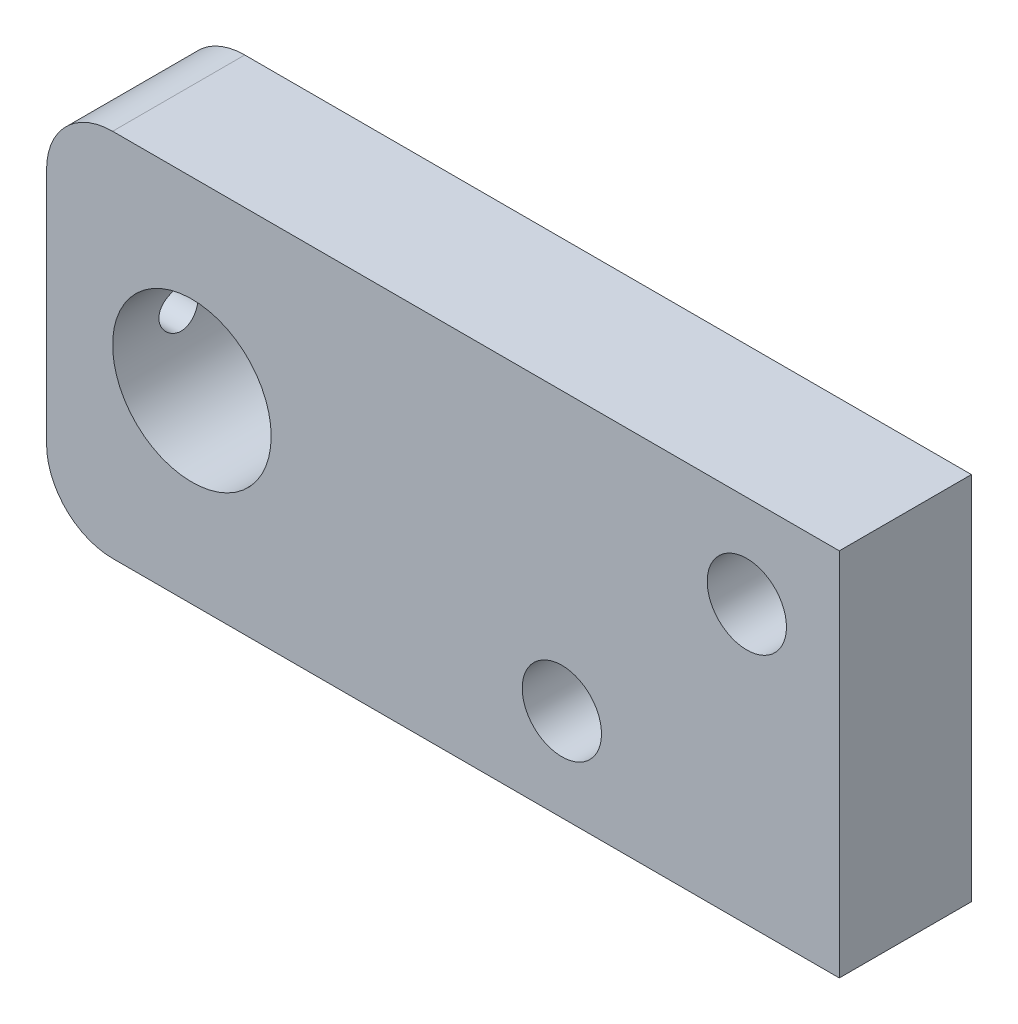
ISO-10303-21;
HEADER;
FILE_DESCRIPTION(('STEP AP214'),'2;1');
FILE_NAME('part.step','',(''),(''),'','','');
FILE_SCHEMA(('AUTOMOTIVE_DESIGN { 1 0 10303 214 1 1 1 1 }'));
ENDSEC;
DATA;
#1=APPLICATION_CONTEXT('core data for automotive mechanical design processes');
#2=APPLICATION_PROTOCOL_DEFINITION('international standard','automotive_design',2000,#1);
#3=PRODUCT_CONTEXT('',#1,'mechanical');
#4=PRODUCT('Part','Part','',(#3));
#5=PRODUCT_RELATED_PRODUCT_CATEGORY('part','',(#4));
#6=PRODUCT_DEFINITION_FORMATION('','',#4);
#7=PRODUCT_DEFINITION_CONTEXT('part definition',#1,'design');
#8=PRODUCT_DEFINITION('design','',#6,#7);
#9=PRODUCT_DEFINITION_SHAPE('','',#8);
#10=(LENGTH_UNIT() NAMED_UNIT(*) SI_UNIT(.MILLI.,.METRE.));
#11=(NAMED_UNIT(*) PLANE_ANGLE_UNIT() SI_UNIT($,.RADIAN.));
#12=(NAMED_UNIT(*) SI_UNIT($,.STERADIAN.) SOLID_ANGLE_UNIT());
#13=UNCERTAINTY_MEASURE_WITH_UNIT(LENGTH_MEASURE(1.E-05),#10,'distance_accuracy_value','');
#14=(GEOMETRIC_REPRESENTATION_CONTEXT(3) GLOBAL_UNCERTAINTY_ASSIGNED_CONTEXT((#13)) GLOBAL_UNIT_ASSIGNED_CONTEXT((#10,
#11,#12)) REPRESENTATION_CONTEXT('',''));
#15=CARTESIAN_POINT('',(0.,0.,0.));
#16=DIRECTION('',(0.,0.,1.));
#17=DIRECTION('',(1.,0.,0.));
#18=AXIS2_PLACEMENT_3D('',#15,#16,#17);
#19=CARTESIAN_POINT('',(-25.,9.,10.));
#20=DIRECTION('',(0.,0.,1.));
#21=DIRECTION('',(1.,0.,0.));
#22=AXIS2_PLACEMENT_3D('',#19,#20,#21);
#23=PLANE('',#22);
#24=CARTESIAN_POINT('',(-19.,0.,10.));
#25=DIRECTION('',(0.,0.,1.));
#26=DIRECTION('',(1.,0.,0.));
#27=AXIS2_PLACEMENT_3D('',#24,#25,#26);
#28=CIRCLE('',#27,6.);
#29=CARTESIAN_POINT('',(-13.,0.,10.));
#30=VERTEX_POINT('',#29);
#31=EDGE_CURVE('E192',#30,#30,#28,.T.);
#32=ORIENTED_EDGE('',*,*,#31,.F.);
#33=EDGE_LOOP('',(#32));
#34=FACE_BOUND('',#33,.T.);
#35=DIRECTION('',(0.,1.,0.));
#36=VECTOR('',#35,1.);
#37=CARTESIAN_POINT('',(30.,-14.,10.));
#38=LINE('',#37,#36);
#39=CARTESIAN_POINT('',(30.,-14.,10.));
#40=VERTEX_POINT('',#39);
#41=CARTESIAN_POINT('',(30.,14.,10.));
#42=VERTEX_POINT('',#41);
#43=EDGE_CURVE('E129',#40,#42,#38,.T.);
#44=ORIENTED_EDGE('',*,*,#43,.T.);
#45=DIRECTION('',(-1.,0.,0.));
#46=VECTOR('',#45,1.);
#47=CARTESIAN_POINT('',(30.,14.,10.));
#48=LINE('',#47,#46);
#49=CARTESIAN_POINT('',(-25.,14.,10.));
#50=VERTEX_POINT('',#49);
#51=EDGE_CURVE('E87',#42,#50,#48,.T.);
#52=ORIENTED_EDGE('',*,*,#51,.T.);
#53=CARTESIAN_POINT('',(-25.,9.,10.));
#54=DIRECTION('',(0.,0.,1.));
#55=DIRECTION('',(1.,0.,0.));
#56=AXIS2_PLACEMENT_3D('',#53,#54,#55);
#57=CIRCLE('',#56,5.);
#58=CARTESIAN_POINT('',(-30.,9.,10.));
#59=VERTEX_POINT('',#58);
#60=EDGE_CURVE('E100',#50,#59,#57,.T.);
#61=ORIENTED_EDGE('',*,*,#60,.T.);
#62=DIRECTION('',(0.,-1.,0.));
#63=VECTOR('',#62,1.);
#64=CARTESIAN_POINT('',(-30.,-9.00000000000001,10.));
#65=LINE('',#64,#63);
#66=CARTESIAN_POINT('',(-30.,-9.00000000000001,10.));
#67=VERTEX_POINT('',#66);
#68=EDGE_CURVE('E94',#59,#67,#65,.T.);
#69=ORIENTED_EDGE('',*,*,#68,.T.);
#70=CARTESIAN_POINT('',(-25.,-9.00000000000001,10.));
#71=DIRECTION('',(0.,0.,1.));
#72=DIRECTION('',(-1.,0.,0.));
#73=AXIS2_PLACEMENT_3D('',#70,#71,#72);
#74=CIRCLE('',#73,5.);
#75=CARTESIAN_POINT('',(-25.,-14.,10.));
#76=VERTEX_POINT('',#75);
#77=EDGE_CURVE('E98',#67,#76,#74,.T.);
#78=ORIENTED_EDGE('',*,*,#77,.T.);
#79=DIRECTION('',(1.,0.,0.));
#80=VECTOR('',#79,1.);
#81=CARTESIAN_POINT('',(30.,-14.,10.));
#82=LINE('',#81,#80);
#83=EDGE_CURVE('E50',#76,#40,#82,.T.);
#84=ORIENTED_EDGE('',*,*,#83,.T.);
#85=EDGE_LOOP('',(#44,#52,#61,#69,#78,#84));
#86=FACE_BOUND('',#85,.T.);
#87=CARTESIAN_POINT('',(23.,7.,10.));
#88=DIRECTION('',(0.,0.,1.));
#89=DIRECTION('',(1.,0.,0.));
#90=AXIS2_PLACEMENT_3D('',#87,#88,#89);
#91=CIRCLE('',#90,3.);
#92=CARTESIAN_POINT('',(26.,7.,10.));
#93=VERTEX_POINT('',#92);
#94=EDGE_CURVE('E122',#93,#93,#91,.T.);
#95=ORIENTED_EDGE('',*,*,#94,.F.);
#96=EDGE_LOOP('',(#95));
#97=FACE_BOUND('',#96,.T.);
#98=CARTESIAN_POINT('',(9.00000000000001,-7.,10.));
#99=DIRECTION('',(0.,0.,1.));
#100=DIRECTION('',(1.,0.,0.));
#101=AXIS2_PLACEMENT_3D('',#98,#99,#100);
#102=CIRCLE('',#101,3.);
#103=CARTESIAN_POINT('',(12.,-7.,10.));
#104=VERTEX_POINT('',#103);
#105=EDGE_CURVE('E185',#104,#104,#102,.T.);
#106=ORIENTED_EDGE('',*,*,#105,.F.);
#107=EDGE_LOOP('',(#106));
#108=FACE_BOUND('',#107,.T.);
#109=ADVANCED_FACE('F33',(#34,#86,#97,#108),#23,.T.);
#110=CARTESIAN_POINT('',(-25.,9.,0.));
#111=DIRECTION('',(0.,0.,1.));
#112=DIRECTION('',(1.,0.,0.));
#113=AXIS2_PLACEMENT_3D('',#110,#111,#112);
#114=PLANE('',#113);
#115=DIRECTION('',(0.,1.,0.));
#116=VECTOR('',#115,1.);
#117=CARTESIAN_POINT('',(30.,-14.,0.));
#118=LINE('',#117,#116);
#119=CARTESIAN_POINT('',(30.,-14.,0.));
#120=VERTEX_POINT('',#119);
#121=CARTESIAN_POINT('',(30.,14.,0.));
#122=VERTEX_POINT('',#121);
#123=EDGE_CURVE('E118',#120,#122,#118,.T.);
#124=ORIENTED_EDGE('',*,*,#123,.F.);
#125=DIRECTION('',(1.,0.,0.));
#126=VECTOR('',#125,1.);
#127=CARTESIAN_POINT('',(30.,-14.,0.));
#128=LINE('',#127,#126);
#129=CARTESIAN_POINT('',(-25.,-14.,0.));
#130=VERTEX_POINT('',#129);
#131=EDGE_CURVE('E79',#130,#120,#128,.T.);
#132=ORIENTED_EDGE('',*,*,#131,.F.);
#133=CARTESIAN_POINT('',(-25.,-9.00000000000001,0.));
#134=DIRECTION('',(0.,0.,1.));
#135=DIRECTION('',(-1.,0.,0.));
#136=AXIS2_PLACEMENT_3D('',#133,#134,#135);
#137=CIRCLE('',#136,5.);
#138=CARTESIAN_POINT('',(-30.,-9.00000000000001,0.));
#139=VERTEX_POINT('',#138);
#140=EDGE_CURVE('E73',#139,#130,#137,.T.);
#141=ORIENTED_EDGE('',*,*,#140,.F.);
#142=DIRECTION('',(0.,-1.,0.));
#143=VECTOR('',#142,1.);
#144=CARTESIAN_POINT('',(-30.,-9.00000000000001,0.));
#145=LINE('',#144,#143);
#146=CARTESIAN_POINT('',(-30.,9.,0.));
#147=VERTEX_POINT('',#146);
#148=EDGE_CURVE('E108',#147,#139,#145,.T.);
#149=ORIENTED_EDGE('',*,*,#148,.F.);
#150=CARTESIAN_POINT('',(-25.,9.,0.));
#151=DIRECTION('',(0.,0.,1.));
#152=DIRECTION('',(1.,0.,0.));
#153=AXIS2_PLACEMENT_3D('',#150,#151,#152);
#154=CIRCLE('',#153,5.);
#155=CARTESIAN_POINT('',(-25.,14.,0.));
#156=VERTEX_POINT('',#155);
#157=EDGE_CURVE('E124',#156,#147,#154,.T.);
#158=ORIENTED_EDGE('',*,*,#157,.F.);
#159=DIRECTION('',(-1.,0.,0.));
#160=VECTOR('',#159,1.);
#161=CARTESIAN_POINT('',(30.,14.,0.));
#162=LINE('',#161,#160);
#163=EDGE_CURVE('E121',#122,#156,#162,.T.);
#164=ORIENTED_EDGE('',*,*,#163,.F.);
#165=EDGE_LOOP('',(#124,#132,#141,#149,#158,#164));
#166=FACE_BOUND('',#165,.T.);
#167=CARTESIAN_POINT('',(23.,7.,0.));
#168=DIRECTION('',(0.,0.,1.));
#169=DIRECTION('',(1.,0.,0.));
#170=AXIS2_PLACEMENT_3D('',#167,#168,#169);
#171=CIRCLE('',#170,3.);
#172=CARTESIAN_POINT('',(26.,7.,0.));
#173=VERTEX_POINT('',#172);
#174=EDGE_CURVE('E195',#173,#173,#171,.T.);
#175=ORIENTED_EDGE('',*,*,#174,.T.);
#176=EDGE_LOOP('',(#175));
#177=FACE_BOUND('',#176,.T.);
#178=CARTESIAN_POINT('',(-19.,0.,0.));
#179=DIRECTION('',(0.,0.,1.));
#180=DIRECTION('',(1.,0.,0.));
#181=AXIS2_PLACEMENT_3D('',#178,#179,#180);
#182=CIRCLE('',#181,6.);
#183=CARTESIAN_POINT('',(-13.,0.,0.));
#184=VERTEX_POINT('',#183);
#185=EDGE_CURVE('E188',#184,#184,#182,.T.);
#186=ORIENTED_EDGE('',*,*,#185,.T.);
#187=EDGE_LOOP('',(#186));
#188=FACE_BOUND('',#187,.T.);
#189=CARTESIAN_POINT('',(9.00000000000001,-7.,0.));
#190=DIRECTION('',(0.,0.,1.));
#191=DIRECTION('',(1.,0.,0.));
#192=AXIS2_PLACEMENT_3D('',#189,#190,#191);
#193=CIRCLE('',#192,3.);
#194=CARTESIAN_POINT('',(12.,-7.,0.));
#195=VERTEX_POINT('',#194);
#196=EDGE_CURVE('E189',#195,#195,#193,.T.);
#197=ORIENTED_EDGE('',*,*,#196,.T.);
#198=EDGE_LOOP('',(#197));
#199=FACE_BOUND('',#198,.T.);
#200=ADVANCED_FACE('F138',(#166,#177,#188,#199),#114,.F.);
#201=CARTESIAN_POINT('',(30.,-14.,10.));
#202=DIRECTION('',(-1.,0.,0.));
#203=DIRECTION('',(0.,0.,1.));
#204=AXIS2_PLACEMENT_3D('',#201,#202,#203);
#205=PLANE('',#204);
#206=ORIENTED_EDGE('',*,*,#123,.T.);
#207=DIRECTION('',(0.,0.,-1.));
#208=VECTOR('',#207,1.);
#209=CARTESIAN_POINT('',(30.,14.,10.));
#210=LINE('',#209,#208);
#211=EDGE_CURVE('E11',#42,#122,#210,.T.);
#212=ORIENTED_EDGE('',*,*,#211,.F.);
#213=ORIENTED_EDGE('',*,*,#43,.F.);
#214=DIRECTION('',(0.,0.,-1.));
#215=VECTOR('',#214,1.);
#216=CARTESIAN_POINT('',(30.,-14.,10.));
#217=LINE('',#216,#215);
#218=EDGE_CURVE('E114',#40,#120,#217,.T.);
#219=ORIENTED_EDGE('',*,*,#218,.T.);
#220=EDGE_LOOP('',(#206,#212,#213,#219));
#221=FACE_BOUND('',#220,.T.);
#222=ADVANCED_FACE('F35',(#221),#205,.F.);
#223=CARTESIAN_POINT('',(30.,14.,10.));
#224=DIRECTION('',(0.,-1.,0.));
#225=DIRECTION('',(1.,0.,0.));
#226=AXIS2_PLACEMENT_3D('',#223,#224,#225);
#227=PLANE('',#226);
#228=ORIENTED_EDGE('',*,*,#163,.T.);
#229=DIRECTION('',(0.,0.,-1.));
#230=VECTOR('',#229,1.);
#231=CARTESIAN_POINT('',(-25.,14.,10.));
#232=LINE('',#231,#230);
#233=EDGE_CURVE('E42',#50,#156,#232,.T.);
#234=ORIENTED_EDGE('',*,*,#233,.F.);
#235=ORIENTED_EDGE('',*,*,#51,.F.);
#236=ORIENTED_EDGE('',*,*,#211,.T.);
#237=EDGE_LOOP('',(#228,#234,#235,#236));
#238=FACE_BOUND('',#237,.T.);
#239=ADVANCED_FACE('F224',(#238),#227,.F.);
#240=CARTESIAN_POINT('',(-25.,9.,10.));
#241=DIRECTION('',(0.,0.,-1.));
#242=DIRECTION('',(-1.,0.,0.));
#243=AXIS2_PLACEMENT_3D('',#240,#241,#242);
#244=CYLINDRICAL_SURFACE('',#243,5.);
#245=ORIENTED_EDGE('',*,*,#157,.T.);
#246=DIRECTION('',(0.,0.,-1.));
#247=VECTOR('',#246,1.);
#248=CARTESIAN_POINT('',(-30.,9.,10.));
#249=LINE('',#248,#247);
#250=EDGE_CURVE('E109',#59,#147,#249,.T.);
#251=ORIENTED_EDGE('',*,*,#250,.F.);
#252=ORIENTED_EDGE('',*,*,#60,.F.);
#253=ORIENTED_EDGE('',*,*,#233,.T.);
#254=EDGE_LOOP('',(#245,#251,#252,#253));
#255=FACE_BOUND('',#254,.T.);
#256=ADVANCED_FACE('F135',(#255),#244,.T.);
#257=CARTESIAN_POINT('',(-30.,-9.00000000000001,10.));
#258=DIRECTION('',(1.,0.,0.));
#259=DIRECTION('',(0.,0.,-1.));
#260=AXIS2_PLACEMENT_3D('',#257,#258,#259);
#261=PLANE('',#260);
#262=CARTESIAN_POINT('',(-30.,0.,5.));
#263=DIRECTION('',(-1.,0.,0.));
#264=DIRECTION('',(0.,0.,1.));
#265=AXIS2_PLACEMENT_3D('',#262,#263,#264);
#266=CIRCLE('',#265,1.5);
#267=CARTESIAN_POINT('',(-30.,0.,6.5));
#268=VERTEX_POINT('',#267);
#269=EDGE_CURVE('E184',#268,#268,#266,.T.);
#270=ORIENTED_EDGE('',*,*,#269,.F.);
#271=EDGE_LOOP('',(#270));
#272=FACE_BOUND('',#271,.T.);
#273=ORIENTED_EDGE('',*,*,#148,.T.);
#274=DIRECTION('',(0.,0.,-1.));
#275=VECTOR('',#274,1.);
#276=CARTESIAN_POINT('',(-30.,-9.00000000000001,10.));
#277=LINE('',#276,#275);
#278=EDGE_CURVE('E105',#67,#139,#277,.T.);
#279=ORIENTED_EDGE('',*,*,#278,.F.);
#280=ORIENTED_EDGE('',*,*,#68,.F.);
#281=ORIENTED_EDGE('',*,*,#250,.T.);
#282=EDGE_LOOP('',(#273,#279,#280,#281));
#283=FACE_BOUND('',#282,.T.);
#284=ADVANCED_FACE('F106',(#272,#283),#261,.F.);
#285=CARTESIAN_POINT('',(-25.,-9.00000000000001,10.));
#286=DIRECTION('',(0.,0.,-1.));
#287=DIRECTION('',(-1.,0.,0.));
#288=AXIS2_PLACEMENT_3D('',#285,#286,#287);
#289=CYLINDRICAL_SURFACE('',#288,5.);
#290=ORIENTED_EDGE('',*,*,#140,.T.);
#291=DIRECTION('',(0.,0.,-1.));
#292=VECTOR('',#291,1.);
#293=CARTESIAN_POINT('',(-25.,-14.,10.));
#294=LINE('',#293,#292);
#295=EDGE_CURVE('E110',#76,#130,#294,.T.);
#296=ORIENTED_EDGE('',*,*,#295,.F.);
#297=ORIENTED_EDGE('',*,*,#77,.F.);
#298=ORIENTED_EDGE('',*,*,#278,.T.);
#299=EDGE_LOOP('',(#290,#296,#297,#298));
#300=FACE_BOUND('',#299,.T.);
#301=ADVANCED_FACE('F112',(#300),#289,.T.);
#302=CARTESIAN_POINT('',(30.,-14.,10.));
#303=DIRECTION('',(0.,1.,0.));
#304=DIRECTION('',(-1.,0.,0.));
#305=AXIS2_PLACEMENT_3D('',#302,#303,#304);
#306=PLANE('',#305);
#307=ORIENTED_EDGE('',*,*,#131,.T.);
#308=ORIENTED_EDGE('',*,*,#218,.F.);
#309=ORIENTED_EDGE('',*,*,#83,.F.);
#310=ORIENTED_EDGE('',*,*,#295,.T.);
#311=EDGE_LOOP('',(#307,#308,#309,#310));
#312=FACE_BOUND('',#311,.T.);
#313=ADVANCED_FACE('F143',(#312),#306,.F.);
#314=CARTESIAN_POINT('',(23.,7.,10.));
#315=DIRECTION('',(0.,0.,-1.));
#316=DIRECTION('',(-1.,0.,0.));
#317=AXIS2_PLACEMENT_3D('',#314,#315,#316);
#318=CYLINDRICAL_SURFACE('',#317,3.);
#319=ORIENTED_EDGE('',*,*,#94,.T.);
#320=EDGE_LOOP('',(#319));
#321=FACE_BOUND('',#320,.T.);
#322=ORIENTED_EDGE('',*,*,#174,.F.);
#323=EDGE_LOOP('',(#322));
#324=FACE_BOUND('',#323,.T.);
#325=ADVANCED_FACE('F145',(#321,#324),#318,.F.);
#326=CARTESIAN_POINT('',(-19.,0.,10.));
#327=DIRECTION('',(0.,0.,-1.));
#328=DIRECTION('',(-1.,0.,0.));
#329=AXIS2_PLACEMENT_3D('',#326,#327,#328);
#330=CYLINDRICAL_SURFACE('',#329,6.);
#331=CARTESIAN_POINT('',(-25.,0.,6.5));
#332=CARTESIAN_POINT('',(-24.9999985986801,0.082876088669731,6.49999767426184));
#333=CARTESIAN_POINT('',(-24.9982657813183,0.165778157830763,6.49310844922621));
#334=CARTESIAN_POINT('',(-24.9915211382989,0.329206323770532,6.465774848693));
#335=CARTESIAN_POINT('',(-24.9865074541997,0.409731046870739,6.44532279046215));
#336=CARTESIAN_POINT('',(-24.9737562633204,0.566020872182577,6.39156074653791));
#337=CARTESIAN_POINT('',(-24.9660220284209,0.641791563430003,6.35826620128472));
#338=CARTESIAN_POINT('',(-24.9486534380759,0.786672131904426,6.27981860995517));
#339=CARTESIAN_POINT('',(-24.9390190185405,0.855781784348759,6.23466516388106));
#340=CARTESIAN_POINT('',(-24.918674135918,0.986801927300919,6.13279921034579));
#341=CARTESIAN_POINT('',(-24.9079470714853,1.04855569006107,6.07588842504082));
#342=CARTESIAN_POINT('',(-24.8867362011753,1.1617489272033,5.95254779509108));
#343=CARTESIAN_POINT('',(-24.8762524228835,1.21318723694913,5.8861168770535));
#344=CARTESIAN_POINT('',(-24.8565477569971,1.30502654279903,5.74440477326256));
#345=CARTESIAN_POINT('',(-24.8473479447061,1.34525221592536,5.6690067691896));
#346=CARTESIAN_POINT('',(-24.8314949481222,1.41239690855053,5.51225158834164));
#347=CARTESIAN_POINT('',(-24.8248413567279,1.43931805543933,5.43089536667424));
#348=CARTESIAN_POINT('',(-24.8150047671755,1.47855483680429,5.26625650179753));
#349=CARTESIAN_POINT('',(-24.8117549107543,1.49115226833334,5.1830451039502));
#350=CARTESIAN_POINT('',(-24.8088936253774,1.50226177506785,5.01563143098602));
#351=CARTESIAN_POINT('',(-24.8092816044864,1.50077614181798,4.93142931930139));
#352=CARTESIAN_POINT('',(-24.8135920549662,1.48398652463928,4.76658419225552));
#353=CARTESIAN_POINT('',(-24.8174286300188,1.46901834019052,4.6859043785349));
#354=CARTESIAN_POINT('',(-24.8280670967648,1.42622418690311,4.52823894908871));
#355=CARTESIAN_POINT('',(-24.834869199707,1.39839730206942,4.45125359697102));
#356=CARTESIAN_POINT('',(-24.8507511390419,1.33038947793715,4.30226198374793));
#357=CARTESIAN_POINT('',(-24.8598532746942,1.29008666723291,4.23031382821045));
#358=CARTESIAN_POINT('',(-24.8792971084639,1.19835627601496,4.09408129024316));
#359=CARTESIAN_POINT('',(-24.8896390233473,1.14692674880884,4.02979825193274));
#360=CARTESIAN_POINT('',(-24.9107588053978,1.03266342468122,3.9087963843056));
#361=CARTESIAN_POINT('',(-24.9215406947797,0.969546258165861,3.85234550993865));
#362=CARTESIAN_POINT('',(-24.9420596557879,0.834611917503701,3.7507787575361));
#363=CARTESIAN_POINT('',(-24.9517966954941,0.762794477707945,3.70566322573643));
#364=CARTESIAN_POINT('',(-24.9691773209418,0.612115888681393,3.62794941377561));
#365=CARTESIAN_POINT('',(-24.9768136012772,0.533231393208624,3.59539465974557));
#366=CARTESIAN_POINT('',(-24.9890791699142,0.370876008142884,3.54408269429043));
#367=CARTESIAN_POINT('',(-24.9937090333928,0.287405999150486,3.52532284358186));
#368=CARTESIAN_POINT('',(-24.9993549927137,0.120539970390028,3.50254243444116));
#369=CARTESIAN_POINT('',(-25.0004605350828,0.0371967199882106,3.4981569739247));
#370=CARTESIAN_POINT('',(-24.9991880481445,-0.129032874801507,3.50324900205549));
#371=CARTESIAN_POINT('',(-24.9968103324185,-0.211919259644594,3.51272524279913));
#372=CARTESIAN_POINT('',(-24.9888958112736,-0.373614268776491,3.54497090839138));
#373=CARTESIAN_POINT('',(-24.9834063418581,-0.452465118968754,3.56754126347699));
#374=CARTESIAN_POINT('',(-24.9698870663413,-0.605257292452511,3.62510708402845));
#375=CARTESIAN_POINT('',(-24.9618570036989,-0.679198119032634,3.66010380431317));
#376=CARTESIAN_POINT('',(-24.9439330792631,-0.821523134429847,3.74223612887473));
#377=CARTESIAN_POINT('',(-24.9340086736693,-0.88978544183583,3.78957611239676));
#378=CARTESIAN_POINT('',(-24.9134450918742,-1.01752661364325,3.89478990879697));
#379=CARTESIAN_POINT('',(-24.902805792517,-1.07700395897301,3.95266553961691));
#380=CARTESIAN_POINT('',(-24.8816895696077,-1.18699056807273,4.07900196084446));
#381=CARTESIAN_POINT('',(-24.8712230418728,-1.23724386762203,4.14768770300242));
#382=CARTESIAN_POINT('',(-24.8519287837724,-1.3255107590127,4.29273263446572));
#383=CARTESIAN_POINT('',(-24.8431009806703,-1.36352489415794,4.36909148295975));
#384=CARTESIAN_POINT('',(-24.8281809473466,-1.42595142060929,4.52690572241308));
#385=CARTESIAN_POINT('',(-24.8220725529191,-1.45044439665407,4.60832762834401));
#386=CARTESIAN_POINT('',(-24.8132674409018,-1.48534565995378,4.77430963788911));
#387=CARTESIAN_POINT('',(-24.8105699771994,-1.49575702747866,4.85886905103249));
#388=CARTESIAN_POINT('',(-24.8089490120396,-1.502038590334,5.0261210238552));
#389=CARTESIAN_POINT('',(-24.8099193272826,-1.49831789778012,5.10879743512473));
#390=CARTESIAN_POINT('',(-24.8152790900784,-1.47737727831287,5.27230388866798));
#391=CARTESIAN_POINT('',(-24.8196684689186,-1.46015762268677,5.35313396801365));
#392=CARTESIAN_POINT('',(-24.8313126068272,-1.41293131944279,5.51020845906541));
#393=CARTESIAN_POINT('',(-24.8385501523631,-1.38300140468038,5.58647730524021));
#394=CARTESIAN_POINT('',(-24.8550775572483,-1.31126491360507,5.73296538271369));
#395=CARTESIAN_POINT('',(-24.8643677012077,-1.26945669003419,5.80318377318692));
#396=CARTESIAN_POINT('',(-24.8842563426351,-1.17386774863714,5.93755462900202));
#397=CARTESIAN_POINT('',(-24.8948826483176,-1.11980316291226,6.00150107342396));
#398=CARTESIAN_POINT('',(-24.9160802724629,-1.00178937118974,6.11954704479541));
#399=CARTESIAN_POINT('',(-24.9266515772706,-0.937837821261146,6.17364423011297));
#400=CARTESIAN_POINT('',(-24.9467765564766,-0.800467586702591,6.27141130856461));
#401=CARTESIAN_POINT('',(-24.9563083336587,-0.726898422316387,6.31487461367158));
#402=CARTESIAN_POINT('',(-24.9730492497512,-0.573266059510477,6.38874746294053));
#403=CARTESIAN_POINT('',(-24.9802600519978,-0.49320756343674,6.41916636064854));
#404=CARTESIAN_POINT('',(-24.9904805956554,-0.344410253243472,6.46157183032965));
#405=CARTESIAN_POINT('',(-24.9940258505269,-0.276380170908068,6.47595124305343));
#406=CARTESIAN_POINT('',(-24.9987860523195,-0.138906071536283,6.49516594362194));
#407=CARTESIAN_POINT('',(-25.0000011745089,-0.069462161242616,6.5000019493053));
#408=CARTESIAN_POINT('',(-25.,0.,6.5));
#409=B_SPLINE_CURVE_WITH_KNOTS('',3,(#331,#332,#333,#334,#335,#336,#337,#338,#339,#340,#341,
#342,#343,#344,#345,#346,#347,#348,#349,#350,#351,#352,#353,#354,#355,#356,#357,#358,#359,#360,
#361,#362,#363,#364,#365,#366,#367,#368,#369,#370,#371,#372,#373,#374,#375,#376,#377,#378,#379,
#380,#381,#382,#383,#384,#385,#386,#387,#388,#389,#390,#391,#392,#393,#394,#395,#396,#397,#398,
#399,#400,#401,#402,#403,#404,#405,#406,#407,#408),.UNSPECIFIED.,.T.,.F.,(4,2,2,2,2,2,2,2,2,2,2,
2,2,2,2,2,2,2,2,2,2,2,2,2,2,2,2,2,2,2,2,2,2,2,2,2,2,2,4),(0.,0.24837371247189,0.4968882377639,
0.745104902286106,0.993329940169328,1.24614435437139,1.49898729580062,1.75558647545807,
2.01214461169368,2.2635629509943,2.51494038112697,2.76022497007018,3.00552703466038,
3.25330527873879,3.50112690836163,3.75601500969019,4.01091089558247,4.26668229009114,
4.52240473688643,4.77158308949276,5.02073901112743,5.26620274514037,5.5116912732229,
5.76153587565352,6.01142363008019,6.26744509204476,6.52345518749508,6.77792254614036,
7.03233423252408,7.27943780398613,7.52653640956034,7.77216400559447,8.01782568136901,
8.2698957640991,8.52202569770418,8.77872185499588,9.0352336382135,9.24342242942149,
9.4515955604304),.UNSPECIFIED.);
#410=CARTESIAN_POINT('',(-25.,0.,6.5));
#411=VERTEX_POINT('',#410);
#412=EDGE_CURVE('E178',#411,#411,#409,.T.);
#413=ORIENTED_EDGE('',*,*,#412,.T.);
#414=EDGE_LOOP('',(#413));
#415=FACE_BOUND('',#414,.T.);
#416=ORIENTED_EDGE('',*,*,#31,.T.);
#417=EDGE_LOOP('',(#416));
#418=FACE_BOUND('',#417,.T.);
#419=ORIENTED_EDGE('',*,*,#185,.F.);
#420=EDGE_LOOP('',(#419));
#421=FACE_BOUND('',#420,.T.);
#422=ADVANCED_FACE('F151',(#415,#418,#421),#330,.F.);
#423=CARTESIAN_POINT('',(9.00000000000001,-7.,10.));
#424=DIRECTION('',(0.,0.,-1.));
#425=DIRECTION('',(-1.,0.,0.));
#426=AXIS2_PLACEMENT_3D('',#423,#424,#425);
#427=CYLINDRICAL_SURFACE('',#426,3.);
#428=ORIENTED_EDGE('',*,*,#105,.T.);
#429=EDGE_LOOP('',(#428));
#430=FACE_BOUND('',#429,.T.);
#431=ORIENTED_EDGE('',*,*,#196,.F.);
#432=EDGE_LOOP('',(#431));
#433=FACE_BOUND('',#432,.T.);
#434=ADVANCED_FACE('F166',(#430,#433),#427,.F.);
#435=CARTESIAN_POINT('',(30.001,0.,5.));
#436=DIRECTION('',(-1.,0.,0.));
#437=DIRECTION('',(0.,0.,1.));
#438=AXIS2_PLACEMENT_3D('',#435,#436,#437);
#439=CYLINDRICAL_SURFACE('',#438,1.5);
#440=ORIENTED_EDGE('',*,*,#412,.F.);
#441=EDGE_LOOP('',(#440));
#442=FACE_BOUND('',#441,.T.);
#443=ORIENTED_EDGE('',*,*,#269,.T.);
#444=EDGE_LOOP('',(#443));
#445=FACE_BOUND('',#444,.T.);
#446=ADVANCED_FACE('F170',(#442,#445),#439,.F.);
#447=CLOSED_SHELL('',(#109,#200,#222,#239,#256,#284,#301,#313,#325,#422,#434,#446));
#448=MANIFOLD_SOLID_BREP('B2',#447);
#449=ADVANCED_BREP_SHAPE_REPRESENTATION('',(#18,#448),#14);
#450=SHAPE_DEFINITION_REPRESENTATION(#9,#449);
ENDSEC;
END-ISO-10303-21;
